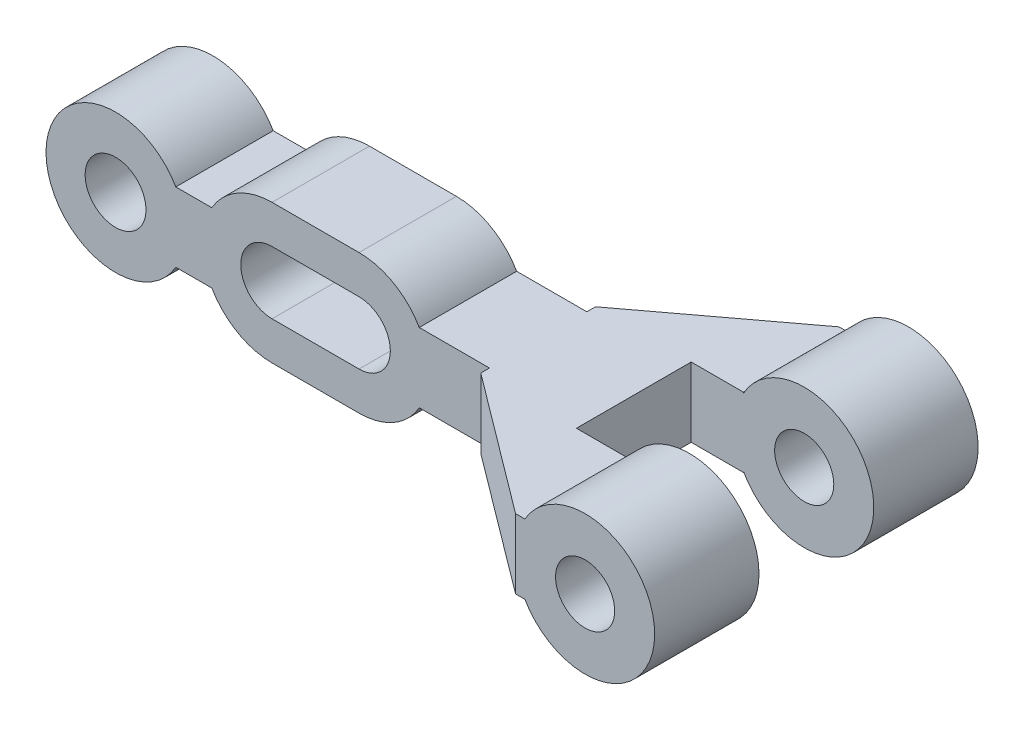
ISO-10303-21;
HEADER;
FILE_DESCRIPTION(('STEP AP214'),'2;1');
FILE_NAME('part.step','',(''),(''),'','','');
FILE_SCHEMA(('AUTOMOTIVE_DESIGN { 1 0 10303 214 1 1 1 1 }'));
ENDSEC;
DATA;
#1=APPLICATION_CONTEXT('core data for automotive mechanical design processes');
#2=APPLICATION_PROTOCOL_DEFINITION('international standard','automotive_design',2000,#1);
#3=PRODUCT_CONTEXT('',#1,'mechanical');
#4=PRODUCT('Part','Part','',(#3));
#5=PRODUCT_RELATED_PRODUCT_CATEGORY('part','',(#4));
#6=PRODUCT_DEFINITION_FORMATION('','',#4);
#7=PRODUCT_DEFINITION_CONTEXT('part definition',#1,'design');
#8=PRODUCT_DEFINITION('design','',#6,#7);
#9=PRODUCT_DEFINITION_SHAPE('','',#8);
#10=(LENGTH_UNIT() NAMED_UNIT(*) SI_UNIT(.MILLI.,.METRE.));
#11=(NAMED_UNIT(*) PLANE_ANGLE_UNIT() SI_UNIT($,.RADIAN.));
#12=(NAMED_UNIT(*) SI_UNIT($,.STERADIAN.) SOLID_ANGLE_UNIT());
#13=UNCERTAINTY_MEASURE_WITH_UNIT(LENGTH_MEASURE(1.E-05),#10,'distance_accuracy_value','');
#14=(GEOMETRIC_REPRESENTATION_CONTEXT(3) GLOBAL_UNCERTAINTY_ASSIGNED_CONTEXT((#13)) GLOBAL_UNIT_ASSIGNED_CONTEXT((#10,
#11,#12)) REPRESENTATION_CONTEXT('',''));
#15=CARTESIAN_POINT('',(0.,0.,0.));
#16=DIRECTION('',(0.,0.,1.));
#17=DIRECTION('',(1.,0.,0.));
#18=AXIS2_PLACEMENT_3D('',#15,#16,#17);
#19=CARTESIAN_POINT('',(-12.,-2.,6.));
#20=DIRECTION('',(-1.,0.,0.));
#21=DIRECTION('',(0.,0.,1.));
#22=AXIS2_PLACEMENT_3D('',#19,#20,#21);
#23=PLANE('',#22);
#24=DIRECTION('',(0.,0.,1.));
#25=VECTOR('',#24,1.);
#26=CARTESIAN_POINT('',(-12.,2.,6.));
#27=LINE('',#26,#25);
#28=CARTESIAN_POINT('',(-12.,2.,12.1));
#29=VERTEX_POINT('',#28);
#30=CARTESIAN_POINT('',(-12.,2.,12.6));
#31=VERTEX_POINT('',#30);
#32=EDGE_CURVE('E382',#29,#31,#27,.T.);
#33=ORIENTED_EDGE('',*,*,#32,.F.);
#34=DIRECTION('',(0.,-1.,0.));
#35=VECTOR('',#34,1.);
#36=CARTESIAN_POINT('',(-12.,2.,12.1));
#37=LINE('',#36,#35);
#38=CARTESIAN_POINT('',(-12.,-2.,12.1));
#39=VERTEX_POINT('',#38);
#40=EDGE_CURVE('E307',#29,#39,#37,.T.);
#41=ORIENTED_EDGE('',*,*,#40,.T.);
#42=DIRECTION('',(0.,0.,1.));
#43=VECTOR('',#42,1.);
#44=CARTESIAN_POINT('',(-12.,-2.,6.));
#45=LINE('',#44,#43);
#46=CARTESIAN_POINT('',(-12.,-2.,12.6));
#47=VERTEX_POINT('',#46);
#48=EDGE_CURVE('E408',#39,#47,#45,.T.);
#49=ORIENTED_EDGE('',*,*,#48,.T.);
#50=DIRECTION('',(0.,1.,0.));
#51=VECTOR('',#50,1.);
#52=CARTESIAN_POINT('',(-12.,-2.,12.6));
#53=LINE('',#52,#51);
#54=EDGE_CURVE('E442',#47,#31,#53,.T.);
#55=ORIENTED_EDGE('',*,*,#54,.T.);
#56=EDGE_LOOP('',(#33,#41,#49,#55));
#57=FACE_BOUND('',#56,.T.);
#58=ADVANCED_FACE('F40',(#57),#23,.T.);
#59=CARTESIAN_POINT('',(0.,0.,6.));
#60=DIRECTION('',(0.,0.,1.));
#61=DIRECTION('',(1.,0.,0.));
#62=AXIS2_PLACEMENT_3D('',#59,#60,#61);
#63=PLANE('',#62);
#64=CARTESIAN_POINT('',(0.,0.,6.));
#65=DIRECTION('',(0.,0.,1.));
#66=DIRECTION('',(1.,0.,0.));
#67=AXIS2_PLACEMENT_3D('',#64,#65,#66);
#68=CIRCLE('',#67,4.);
#69=CARTESIAN_POINT('',(-3.5,-1.93649167310371,6.));
#70=VERTEX_POINT('',#69);
#71=CARTESIAN_POINT('',(-3.5,1.93649167310371,6.));
#72=VERTEX_POINT('',#71);
#73=EDGE_CURVE('E454',#70,#72,#68,.T.);
#74=ORIENTED_EDGE('',*,*,#73,.T.);
#75=DIRECTION('',(0.,1.,0.));
#76=VECTOR('',#75,1.);
#77=CARTESIAN_POINT('',(-3.5,-2.,6.));
#78=LINE('',#77,#76);
#79=CARTESIAN_POINT('',(-3.5,2.,6.));
#80=VERTEX_POINT('',#79);
#81=EDGE_CURVE('E434',#72,#80,#78,.T.);
#82=ORIENTED_EDGE('',*,*,#81,.T.);
#83=DIRECTION('',(1.,0.,0.));
#84=VECTOR('',#83,1.);
#85=CARTESIAN_POINT('',(-6.5,2.,6.));
#86=LINE('',#85,#84);
#87=CARTESIAN_POINT('',(-6.5,2.,6.));
#88=VERTEX_POINT('',#87);
#89=EDGE_CURVE('E396',#88,#80,#86,.T.);
#90=ORIENTED_EDGE('',*,*,#89,.F.);
#91=DIRECTION('',(0.,1.,0.));
#92=VECTOR('',#91,1.);
#93=CARTESIAN_POINT('',(-6.5,-2.,6.));
#94=LINE('',#93,#92);
#95=CARTESIAN_POINT('',(-6.5,-2.,6.));
#96=VERTEX_POINT('',#95);
#97=EDGE_CURVE('E435',#96,#88,#94,.T.);
#98=ORIENTED_EDGE('',*,*,#97,.F.);
#99=DIRECTION('',(1.,0.,0.));
#100=VECTOR('',#99,1.);
#101=CARTESIAN_POINT('',(-6.5,-2.,6.));
#102=LINE('',#101,#100);
#103=CARTESIAN_POINT('',(-3.5,-2.,6.));
#104=VERTEX_POINT('',#103);
#105=EDGE_CURVE('E422',#96,#104,#102,.T.);
#106=ORIENTED_EDGE('',*,*,#105,.T.);
#107=EDGE_CURVE('E432',#104,#70,#78,.T.);
#108=ORIENTED_EDGE('',*,*,#107,.T.);
#109=EDGE_LOOP('',(#74,#82,#90,#98,#106,#108));
#110=FACE_BOUND('',#109,.T.);
#111=CARTESIAN_POINT('',(0.,0.,6.));
#112=DIRECTION('',(0.,0.,1.));
#113=DIRECTION('',(1.,0.,0.));
#114=AXIS2_PLACEMENT_3D('',#111,#112,#113);
#115=CIRCLE('',#114,1.7);
#116=CARTESIAN_POINT('',(1.7,0.,6.));
#117=VERTEX_POINT('',#116);
#118=EDGE_CURVE('E448',#117,#117,#115,.T.);
#119=ORIENTED_EDGE('',*,*,#118,.F.);
#120=EDGE_LOOP('',(#119));
#121=FACE_BOUND('',#120,.T.);
#122=ADVANCED_FACE('F482',(#110,#121),#63,.T.);
#123=CARTESIAN_POINT('',(0.,0.,0.));
#124=DIRECTION('',(0.,0.,1.));
#125=DIRECTION('',(1.,0.,0.));
#126=AXIS2_PLACEMENT_3D('',#123,#124,#125);
#127=PLANE('',#126);
#128=CARTESIAN_POINT('',(0.,0.,0.));
#129=DIRECTION('',(0.,0.,1.));
#130=DIRECTION('',(1.,0.,0.));
#131=AXIS2_PLACEMENT_3D('',#128,#129,#130);
#132=CIRCLE('',#131,4.);
#133=CARTESIAN_POINT('',(-3.5,-1.93649167310371,0.));
#134=VERTEX_POINT('',#133);
#135=CARTESIAN_POINT('',(-3.5,1.93649167310371,0.));
#136=VERTEX_POINT('',#135);
#137=EDGE_CURVE('E451',#134,#136,#132,.T.);
#138=ORIENTED_EDGE('',*,*,#137,.F.);
#139=DIRECTION('',(0.,1.,0.));
#140=VECTOR('',#139,1.);
#141=CARTESIAN_POINT('',(-3.5,-2.,0.));
#142=LINE('',#141,#140);
#143=CARTESIAN_POINT('',(-3.5,-2.,0.));
#144=VERTEX_POINT('',#143);
#145=EDGE_CURVE('E428',#144,#134,#142,.T.);
#146=ORIENTED_EDGE('',*,*,#145,.F.);
#147=DIRECTION('',(-1.,0.,0.));
#148=VECTOR('',#147,1.);
#149=CARTESIAN_POINT('',(-4.,-2.,0.));
#150=LINE('',#149,#148);
#151=CARTESIAN_POINT('',(-4.,-2.,0.));
#152=VERTEX_POINT('',#151);
#153=EDGE_CURVE('E402',#144,#152,#150,.T.);
#154=ORIENTED_EDGE('',*,*,#153,.T.);
#155=DIRECTION('',(0.,1.,0.));
#156=VECTOR('',#155,1.);
#157=CARTESIAN_POINT('',(-4.,-2.,0.));
#158=LINE('',#157,#156);
#159=CARTESIAN_POINT('',(-4.,2.,0.));
#160=VERTEX_POINT('',#159);
#161=EDGE_CURVE('E427',#152,#160,#158,.T.);
#162=ORIENTED_EDGE('',*,*,#161,.T.);
#163=DIRECTION('',(-1.,0.,0.));
#164=VECTOR('',#163,1.);
#165=CARTESIAN_POINT('',(-4.,2.,0.));
#166=LINE('',#165,#164);
#167=CARTESIAN_POINT('',(-3.5,2.,0.));
#168=VERTEX_POINT('',#167);
#169=EDGE_CURVE('E376',#168,#160,#166,.T.);
#170=ORIENTED_EDGE('',*,*,#169,.F.);
#171=EDGE_CURVE('E431',#136,#168,#142,.T.);
#172=ORIENTED_EDGE('',*,*,#171,.F.);
#173=EDGE_LOOP('',(#138,#146,#154,#162,#170,#172));
#174=FACE_BOUND('',#173,.T.);
#175=CARTESIAN_POINT('',(0.,0.,0.));
#176=DIRECTION('',(0.,0.,1.));
#177=DIRECTION('',(1.,0.,0.));
#178=AXIS2_PLACEMENT_3D('',#175,#176,#177);
#179=CIRCLE('',#178,1.7);
#180=CARTESIAN_POINT('',(1.7,0.,0.));
#181=VERTEX_POINT('',#180);
#182=EDGE_CURVE('E430',#181,#181,#179,.T.);
#183=ORIENTED_EDGE('',*,*,#182,.T.);
#184=EDGE_LOOP('',(#183));
#185=FACE_BOUND('',#184,.T.);
#186=ADVANCED_FACE('F470',(#174,#185),#127,.F.);
#187=CARTESIAN_POINT('',(0.,0.,6.));
#188=DIRECTION('',(0.,0.,-1.));
#189=DIRECTION('',(-1.,0.,0.));
#190=AXIS2_PLACEMENT_3D('',#187,#188,#189);
#191=CYLINDRICAL_SURFACE('',#190,4.);
#192=ORIENTED_EDGE('',*,*,#73,.F.);
#193=DIRECTION('',(0.,0.,-1.));
#194=VECTOR('',#193,1.);
#195=CARTESIAN_POINT('',(-3.5,-1.93649167310371,6.));
#196=LINE('',#195,#194);
#197=EDGE_CURVE('E48',#70,#134,#196,.T.);
#198=ORIENTED_EDGE('',*,*,#197,.T.);
#199=ORIENTED_EDGE('',*,*,#137,.T.);
#200=DIRECTION('',(0.,0.,-1.));
#201=VECTOR('',#200,1.);
#202=CARTESIAN_POINT('',(-3.5,1.93649167310371,6.));
#203=LINE('',#202,#201);
#204=EDGE_CURVE('E457',#136,#72,#203,.F.);
#205=ORIENTED_EDGE('',*,*,#204,.T.);
#206=EDGE_LOOP('',(#192,#198,#199,#205));
#207=FACE_BOUND('',#206,.T.);
#208=ADVANCED_FACE('F42',(#207),#191,.T.);
#209=CARTESIAN_POINT('',(0.,0.,6.));
#210=DIRECTION('',(0.,0.,-1.));
#211=DIRECTION('',(-1.,0.,0.));
#212=AXIS2_PLACEMENT_3D('',#209,#210,#211);
#213=CYLINDRICAL_SURFACE('',#212,1.7);
#214=ORIENTED_EDGE('',*,*,#118,.T.);
#215=EDGE_LOOP('',(#214));
#216=FACE_BOUND('',#215,.T.);
#217=ORIENTED_EDGE('',*,*,#182,.F.);
#218=EDGE_LOOP('',(#217));
#219=FACE_BOUND('',#218,.T.);
#220=ADVANCED_FACE('F758',(#216,#219),#213,.F.);
#221=CARTESIAN_POINT('',(-3.5,-2.,0.));
#222=DIRECTION('',(1.,0.,0.));
#223=DIRECTION('',(0.,0.,-1.));
#224=AXIS2_PLACEMENT_3D('',#221,#222,#223);
#225=PLANE('',#224);
#226=ORIENTED_EDGE('',*,*,#197,.F.);
#227=ORIENTED_EDGE('',*,*,#107,.F.);
#228=DIRECTION('',(0.,0.,-1.));
#229=VECTOR('',#228,1.);
#230=CARTESIAN_POINT('',(-3.5,-2.,0.));
#231=LINE('',#230,#229);
#232=EDGE_CURVE('E424',#104,#144,#231,.T.);
#233=ORIENTED_EDGE('',*,*,#232,.T.);
#234=ORIENTED_EDGE('',*,*,#145,.T.);
#235=EDGE_LOOP('',(#226,#227,#233,#234));
#236=FACE_BOUND('',#235,.T.);
#237=ADVANCED_FACE('F486',(#236),#225,.T.);
#238=ORIENTED_EDGE('',*,*,#204,.F.);
#239=ORIENTED_EDGE('',*,*,#171,.T.);
#240=DIRECTION('',(0.,0.,-1.));
#241=VECTOR('',#240,1.);
#242=CARTESIAN_POINT('',(-3.5,2.,0.));
#243=LINE('',#242,#241);
#244=EDGE_CURVE('E399',#80,#168,#243,.T.);
#245=ORIENTED_EDGE('',*,*,#244,.F.);
#246=ORIENTED_EDGE('',*,*,#81,.F.);
#247=EDGE_LOOP('',(#238,#239,#245,#246));
#248=FACE_BOUND('',#247,.T.);
#249=ADVANCED_FACE('F476',(#248),#225,.T.);
#250=CARTESIAN_POINT('',(-6.5,-2.,12.6));
#251=DIRECTION('',(1.,0.,0.));
#252=DIRECTION('',(0.,0.,-1.));
#253=AXIS2_PLACEMENT_3D('',#250,#251,#252);
#254=PLANE('',#253);
#255=ORIENTED_EDGE('',*,*,#97,.T.);
#256=DIRECTION('',(0.,0.,-1.));
#257=VECTOR('',#256,1.);
#258=CARTESIAN_POINT('',(-6.5,2.,12.6));
#259=LINE('',#258,#257);
#260=CARTESIAN_POINT('',(-6.5,2.,12.6));
#261=VERTEX_POINT('',#260);
#262=EDGE_CURVE('E393',#261,#88,#259,.T.);
#263=ORIENTED_EDGE('',*,*,#262,.F.);
#264=DIRECTION('',(0.,1.,0.));
#265=VECTOR('',#264,1.);
#266=CARTESIAN_POINT('',(-6.5,-2.,12.6));
#267=LINE('',#266,#265);
#268=CARTESIAN_POINT('',(-6.5,-2.,12.6));
#269=VERTEX_POINT('',#268);
#270=EDGE_CURVE('E437',#269,#261,#267,.T.);
#271=ORIENTED_EDGE('',*,*,#270,.F.);
#272=DIRECTION('',(0.,0.,-1.));
#273=VECTOR('',#272,1.);
#274=CARTESIAN_POINT('',(-6.5,-2.,12.6));
#275=LINE('',#274,#273);
#276=EDGE_CURVE('E419',#269,#96,#275,.T.);
#277=ORIENTED_EDGE('',*,*,#276,.T.);
#278=EDGE_LOOP('',(#255,#263,#271,#277));
#279=FACE_BOUND('',#278,.T.);
#280=ADVANCED_FACE('F531',(#279),#254,.T.);
#281=CARTESIAN_POINT('',(-4.,-2.,12.6));
#282=DIRECTION('',(0.,0.,-1.));
#283=DIRECTION('',(-1.,0.,0.));
#284=AXIS2_PLACEMENT_3D('',#281,#282,#283);
#285=PLANE('',#284);
#286=DIRECTION('',(-1.,0.,0.));
#287=VECTOR('',#286,1.);
#288=CARTESIAN_POINT('',(-4.,2.,12.6));
#289=LINE('',#288,#287);
#290=CARTESIAN_POINT('',(-3.46410161513775,2.,12.6));
#291=VERTEX_POINT('',#290);
#292=EDGE_CURVE('E391',#291,#261,#289,.T.);
#293=ORIENTED_EDGE('',*,*,#292,.F.);
#294=CARTESIAN_POINT('',(0.,0.,12.6));
#295=DIRECTION('',(0.,0.,1.));
#296=DIRECTION('',(1.,0.,0.));
#297=AXIS2_PLACEMENT_3D('',#294,#295,#296);
#298=CIRCLE('',#297,4.);
#299=CARTESIAN_POINT('',(-3.46410161513775,-2.,12.6));
#300=VERTEX_POINT('',#299);
#301=EDGE_CURVE('E370',#300,#291,#298,.T.);
#302=ORIENTED_EDGE('',*,*,#301,.F.);
#303=DIRECTION('',(-1.,0.,0.));
#304=VECTOR('',#303,1.);
#305=CARTESIAN_POINT('',(-4.,-2.,12.6));
#306=LINE('',#305,#304);
#307=EDGE_CURVE('E417',#300,#269,#306,.T.);
#308=ORIENTED_EDGE('',*,*,#307,.T.);
#309=ORIENTED_EDGE('',*,*,#270,.T.);
#310=EDGE_LOOP('',(#293,#302,#308,#309));
#311=FACE_BOUND('',#310,.T.);
#312=CARTESIAN_POINT('',(0.,0.,12.6));
#313=DIRECTION('',(0.,0.,1.));
#314=DIRECTION('',(1.,0.,0.));
#315=AXIS2_PLACEMENT_3D('',#312,#313,#314);
#316=CIRCLE('',#315,1.7);
#317=CARTESIAN_POINT('',(1.7,0.,12.6));
#318=VERTEX_POINT('',#317);
#319=EDGE_CURVE('E364',#318,#318,#316,.T.);
#320=ORIENTED_EDGE('',*,*,#319,.T.);
#321=EDGE_LOOP('',(#320));
#322=FACE_BOUND('',#321,.T.);
#323=ADVANCED_FACE('F527',(#311,#322),#285,.T.);
#324=CARTESIAN_POINT('',(-3.,-2.,18.6));
#325=DIRECTION('',(0.,0.,1.));
#326=DIRECTION('',(1.,0.,0.));
#327=AXIS2_PLACEMENT_3D('',#324,#325,#326);
#328=PLANE('',#327);
#329=DIRECTION('',(1.,0.,0.));
#330=VECTOR('',#329,1.);
#331=CARTESIAN_POINT('',(-3.,-2.,18.6));
#332=LINE('',#331,#330);
#333=CARTESIAN_POINT('',(-4.,-2.,18.6));
#334=VERTEX_POINT('',#333);
#335=CARTESIAN_POINT('',(-3.46410161513775,-2.,18.6));
#336=VERTEX_POINT('',#335);
#337=EDGE_CURVE('E415',#334,#336,#332,.T.);
#338=ORIENTED_EDGE('',*,*,#337,.T.);
#339=CARTESIAN_POINT('',(0.,0.,18.6));
#340=DIRECTION('',(0.,0.,1.));
#341=DIRECTION('',(1.,0.,0.));
#342=AXIS2_PLACEMENT_3D('',#339,#340,#341);
#343=CIRCLE('',#342,4.);
#344=CARTESIAN_POINT('',(-3.46410161513775,2.,18.6));
#345=VERTEX_POINT('',#344);
#346=EDGE_CURVE('E367',#336,#345,#343,.T.);
#347=ORIENTED_EDGE('',*,*,#346,.T.);
#348=DIRECTION('',(1.,0.,0.));
#349=VECTOR('',#348,1.);
#350=CARTESIAN_POINT('',(-3.,2.,18.6));
#351=LINE('',#350,#349);
#352=CARTESIAN_POINT('',(-4.,2.,18.6));
#353=VERTEX_POINT('',#352);
#354=EDGE_CURVE('E389',#353,#345,#351,.T.);
#355=ORIENTED_EDGE('',*,*,#354,.F.);
#356=DIRECTION('',(0.,1.,0.));
#357=VECTOR('',#356,1.);
#358=CARTESIAN_POINT('',(-4.,-2.,18.6));
#359=LINE('',#358,#357);
#360=EDGE_CURVE('E440',#334,#353,#359,.T.);
#361=ORIENTED_EDGE('',*,*,#360,.F.);
#362=EDGE_LOOP('',(#338,#347,#355,#361));
#363=FACE_BOUND('',#362,.T.);
#364=CARTESIAN_POINT('',(0.,0.,18.6));
#365=DIRECTION('',(0.,0.,1.));
#366=DIRECTION('',(1.,0.,0.));
#367=AXIS2_PLACEMENT_3D('',#364,#365,#366);
#368=CIRCLE('',#367,1.7);
#369=CARTESIAN_POINT('',(1.7,0.,18.6));
#370=VERTEX_POINT('',#369);
#371=EDGE_CURVE('E346',#370,#370,#368,.T.);
#372=ORIENTED_EDGE('',*,*,#371,.F.);
#373=EDGE_LOOP('',(#372));
#374=FACE_BOUND('',#373,.T.);
#375=ADVANCED_FACE('F519',(#363,#374),#328,.T.);
#376=CARTESIAN_POINT('',(-12.,-2.,12.6));
#377=DIRECTION('',(-0.6,0.,0.8));
#378=DIRECTION('',(0.8,0.,0.6));
#379=AXIS2_PLACEMENT_3D('',#376,#377,#378);
#380=PLANE('',#379);
#381=ORIENTED_EDGE('',*,*,#360,.T.);
#382=DIRECTION('',(0.8,0.,0.6));
#383=VECTOR('',#382,1.);
#384=CARTESIAN_POINT('',(-12.,2.,12.6));
#385=LINE('',#384,#383);
#386=EDGE_CURVE('E386',#31,#353,#385,.T.);
#387=ORIENTED_EDGE('',*,*,#386,.F.);
#388=ORIENTED_EDGE('',*,*,#54,.F.);
#389=DIRECTION('',(0.8,0.,0.6));
#390=VECTOR('',#389,1.);
#391=CARTESIAN_POINT('',(-12.,-2.,12.6));
#392=LINE('',#391,#390);
#393=EDGE_CURVE('E412',#47,#334,#392,.T.);
#394=ORIENTED_EDGE('',*,*,#393,.T.);
#395=EDGE_LOOP('',(#381,#387,#388,#394));
#396=FACE_BOUND('',#395,.T.);
#397=ADVANCED_FACE('F514',(#396),#380,.T.);
#398=DIRECTION('',(0.,-1.,0.));
#399=VECTOR('',#398,1.);
#400=CARTESIAN_POINT('',(-12.,2.,6.5));
#401=LINE('',#400,#399);
#402=CARTESIAN_POINT('',(-12.,2.,6.5));
#403=VERTEX_POINT('',#402);
#404=CARTESIAN_POINT('',(-12.,-2.,6.5));
#405=VERTEX_POINT('',#404);
#406=EDGE_CURVE('E260',#403,#405,#401,.T.);
#407=ORIENTED_EDGE('',*,*,#406,.F.);
#408=CARTESIAN_POINT('',(-12.,2.,6.));
#409=VERTEX_POINT('',#408);
#410=EDGE_CURVE('E383',#409,#403,#27,.T.);
#411=ORIENTED_EDGE('',*,*,#410,.F.);
#412=DIRECTION('',(0.,1.,0.));
#413=VECTOR('',#412,1.);
#414=CARTESIAN_POINT('',(-12.,-2.,6.));
#415=LINE('',#414,#413);
#416=CARTESIAN_POINT('',(-12.,-2.,6.));
#417=VERTEX_POINT('',#416);
#418=EDGE_CURVE('E445',#417,#409,#415,.T.);
#419=ORIENTED_EDGE('',*,*,#418,.F.);
#420=EDGE_CURVE('E409',#417,#405,#45,.T.);
#421=ORIENTED_EDGE('',*,*,#420,.T.);
#422=EDGE_LOOP('',(#407,#411,#419,#421));
#423=FACE_BOUND('',#422,.T.);
#424=ADVANCED_FACE('F498',(#423),#23,.T.);
#425=CARTESIAN_POINT('',(-4.,-2.,0.));
#426=DIRECTION('',(-0.6,0.,-0.8));
#427=DIRECTION('',(-0.8,0.,0.6));
#428=AXIS2_PLACEMENT_3D('',#425,#426,#427);
#429=PLANE('',#428);
#430=ORIENTED_EDGE('',*,*,#418,.T.);
#431=DIRECTION('',(-0.8,0.,0.6));
#432=VECTOR('',#431,1.);
#433=CARTESIAN_POINT('',(-4.,2.,0.));
#434=LINE('',#433,#432);
#435=EDGE_CURVE('E379',#160,#409,#434,.T.);
#436=ORIENTED_EDGE('',*,*,#435,.F.);
#437=ORIENTED_EDGE('',*,*,#161,.F.);
#438=DIRECTION('',(-0.8,0.,0.6));
#439=VECTOR('',#438,1.);
#440=CARTESIAN_POINT('',(-4.,-2.,0.));
#441=LINE('',#440,#439);
#442=EDGE_CURVE('E405',#152,#417,#441,.T.);
#443=ORIENTED_EDGE('',*,*,#442,.T.);
#444=EDGE_LOOP('',(#430,#436,#437,#443));
#445=FACE_BOUND('',#444,.T.);
#446=ADVANCED_FACE('F493',(#445),#429,.T.);
#447=CARTESIAN_POINT('',(0.,-2.,0.));
#448=DIRECTION('',(0.,-1.,0.));
#449=DIRECTION('',(0.,0.,-1.));
#450=AXIS2_PLACEMENT_3D('',#447,#448,#449);
#451=PLANE('',#450);
#452=DIRECTION('',(0.,0.,1.));
#453=VECTOR('',#452,1.);
#454=CARTESIAN_POINT('',(-3.46410161513775,-2.,12.6));
#455=LINE('',#454,#453);
#456=EDGE_CURVE('E63',#336,#300,#455,.F.);
#457=ORIENTED_EDGE('',*,*,#456,.F.);
#458=ORIENTED_EDGE('',*,*,#337,.F.);
#459=ORIENTED_EDGE('',*,*,#393,.F.);
#460=ORIENTED_EDGE('',*,*,#48,.F.);
#461=DIRECTION('',(-1.,0.,0.));
#462=VECTOR('',#461,1.);
#463=CARTESIAN_POINT('',(-12.,-2.,12.1));
#464=LINE('',#463,#462);
#465=CARTESIAN_POINT('',(-16.0358983848622,-2.,12.1));
#466=VERTEX_POINT('',#465);
#467=EDGE_CURVE('E55',#39,#466,#464,.T.);
#468=ORIENTED_EDGE('',*,*,#467,.T.);
#469=DIRECTION('',(0.,0.,-1.));
#470=VECTOR('',#469,1.);
#471=CARTESIAN_POINT('',(-16.0358983848622,-2.,12.1));
#472=LINE('',#471,#470);
#473=CARTESIAN_POINT('',(-16.0358983848622,-2.,6.5));
#474=VERTEX_POINT('',#473);
#475=EDGE_CURVE('E343',#466,#474,#472,.T.);
#476=ORIENTED_EDGE('',*,*,#475,.T.);
#477=DIRECTION('',(-1.,0.,0.));
#478=VECTOR('',#477,1.);
#479=CARTESIAN_POINT('',(-12.,-2.,6.5));
#480=LINE('',#479,#478);
#481=EDGE_CURVE('E263',#405,#474,#480,.T.);
#482=ORIENTED_EDGE('',*,*,#481,.F.);
#483=ORIENTED_EDGE('',*,*,#420,.F.);
#484=ORIENTED_EDGE('',*,*,#442,.F.);
#485=ORIENTED_EDGE('',*,*,#153,.F.);
#486=ORIENTED_EDGE('',*,*,#232,.F.);
#487=ORIENTED_EDGE('',*,*,#105,.F.);
#488=ORIENTED_EDGE('',*,*,#276,.F.);
#489=ORIENTED_EDGE('',*,*,#307,.F.);
#490=EDGE_LOOP('',(#457,#458,#459,#460,#468,#476,#482,#483,#484,#485,#486,#487,#488,#489));
#491=FACE_BOUND('',#490,.T.);
#492=ADVANCED_FACE('F487',(#491),#451,.T.);
#493=CARTESIAN_POINT('',(0.,2.,0.));
#494=DIRECTION('',(0.,-1.,0.));
#495=DIRECTION('',(0.,0.,-1.));
#496=AXIS2_PLACEMENT_3D('',#493,#494,#495);
#497=PLANE('',#496);
#498=ORIENTED_EDGE('',*,*,#354,.T.);
#499=DIRECTION('',(0.,0.,1.));
#500=VECTOR('',#499,1.);
#501=CARTESIAN_POINT('',(-3.46410161513775,2.,12.6));
#502=LINE('',#501,#500);
#503=EDGE_CURVE('E11',#345,#291,#502,.F.);
#504=ORIENTED_EDGE('',*,*,#503,.T.);
#505=ORIENTED_EDGE('',*,*,#292,.T.);
#506=ORIENTED_EDGE('',*,*,#262,.T.);
#507=ORIENTED_EDGE('',*,*,#89,.T.);
#508=ORIENTED_EDGE('',*,*,#244,.T.);
#509=ORIENTED_EDGE('',*,*,#169,.T.);
#510=ORIENTED_EDGE('',*,*,#435,.T.);
#511=ORIENTED_EDGE('',*,*,#410,.T.);
#512=DIRECTION('',(1.,0.,0.));
#513=VECTOR('',#512,1.);
#514=CARTESIAN_POINT('',(-12.,2.,6.5));
#515=LINE('',#514,#513);
#516=CARTESIAN_POINT('',(-16.0358983848622,2.,6.5));
#517=VERTEX_POINT('',#516);
#518=EDGE_CURVE('E293',#517,#403,#515,.T.);
#519=ORIENTED_EDGE('',*,*,#518,.F.);
#520=DIRECTION('',(0.,0.,-1.));
#521=VECTOR('',#520,1.);
#522=CARTESIAN_POINT('',(-16.0358983848622,2.,12.1));
#523=LINE('',#522,#521);
#524=CARTESIAN_POINT('',(-16.0358983848622,2.,12.1));
#525=VERTEX_POINT('',#524);
#526=EDGE_CURVE('E344',#525,#517,#523,.T.);
#527=ORIENTED_EDGE('',*,*,#526,.F.);
#528=DIRECTION('',(1.,0.,0.));
#529=VECTOR('',#528,1.);
#530=CARTESIAN_POINT('',(-12.,2.,12.1));
#531=LINE('',#530,#529);
#532=EDGE_CURVE('E340',#525,#29,#531,.T.);
#533=ORIENTED_EDGE('',*,*,#532,.T.);
#534=ORIENTED_EDGE('',*,*,#32,.T.);
#535=ORIENTED_EDGE('',*,*,#386,.T.);
#536=EDGE_LOOP('',(#498,#504,#505,#506,#507,#508,#509,#510,#511,#519,#527,#533,#534,#535));
#537=FACE_BOUND('',#536,.T.);
#538=ADVANCED_FACE('F478',(#537),#497,.F.);
#539=CARTESIAN_POINT('',(0.,0.,12.6));
#540=DIRECTION('',(0.,0.,1.));
#541=DIRECTION('',(1.,0.,0.));
#542=AXIS2_PLACEMENT_3D('',#539,#540,#541);
#543=CYLINDRICAL_SURFACE('',#542,4.);
#544=ORIENTED_EDGE('',*,*,#346,.F.);
#545=ORIENTED_EDGE('',*,*,#456,.T.);
#546=ORIENTED_EDGE('',*,*,#301,.T.);
#547=ORIENTED_EDGE('',*,*,#503,.F.);
#548=EDGE_LOOP('',(#544,#545,#546,#547));
#549=FACE_BOUND('',#548,.T.);
#550=ADVANCED_FACE('F523',(#549),#543,.T.);
#551=CARTESIAN_POINT('',(0.,0.,12.6));
#552=DIRECTION('',(0.,0.,1.));
#553=DIRECTION('',(1.,0.,0.));
#554=AXIS2_PLACEMENT_3D('',#551,#552,#553);
#555=CYLINDRICAL_SURFACE('',#554,1.7);
#556=ORIENTED_EDGE('',*,*,#319,.F.);
#557=EDGE_LOOP('',(#556));
#558=FACE_BOUND('',#557,.T.);
#559=ORIENTED_EDGE('',*,*,#371,.T.);
#560=EDGE_LOOP('',(#559));
#561=FACE_BOUND('',#560,.T.);
#562=ADVANCED_FACE('F609',(#558,#561),#555,.F.);
#563=CARTESIAN_POINT('',(-19.5,0.,12.1));
#564=DIRECTION('',(0.,0.,-1.));
#565=DIRECTION('',(-1.,0.,0.));
#566=AXIS2_PLACEMENT_3D('',#563,#564,#565);
#567=CYLINDRICAL_SURFACE('',#566,4.);
#568=ORIENTED_EDGE('',*,*,#526,.T.);
#569=CARTESIAN_POINT('',(-19.5,0.,6.5));
#570=DIRECTION('',(0.,0.,-1.));
#571=DIRECTION('',(-1.,0.,0.));
#572=AXIS2_PLACEMENT_3D('',#569,#570,#571);
#573=CIRCLE('',#572,4.);
#574=CARTESIAN_POINT('',(-19.5,4.,6.5));
#575=VERTEX_POINT('',#574);
#576=EDGE_CURVE('E290',#575,#517,#573,.T.);
#577=ORIENTED_EDGE('',*,*,#576,.F.);
#578=DIRECTION('',(0.,0.,-1.));
#579=VECTOR('',#578,1.);
#580=CARTESIAN_POINT('',(-19.5,4.,12.1));
#581=LINE('',#580,#579);
#582=CARTESIAN_POINT('',(-19.5,4.,12.1));
#583=VERTEX_POINT('',#582);
#584=EDGE_CURVE('E347',#583,#575,#581,.T.);
#585=ORIENTED_EDGE('',*,*,#584,.F.);
#586=CARTESIAN_POINT('',(-19.5,0.,12.1));
#587=DIRECTION('',(0.,0.,-1.));
#588=DIRECTION('',(-1.,0.,0.));
#589=AXIS2_PLACEMENT_3D('',#586,#587,#588);
#590=CIRCLE('',#589,4.);
#591=EDGE_CURVE('E337',#583,#525,#590,.T.);
#592=ORIENTED_EDGE('',*,*,#591,.T.);
#593=EDGE_LOOP('',(#568,#577,#585,#592));
#594=FACE_BOUND('',#593,.T.);
#595=ADVANCED_FACE('F506',(#594),#567,.T.);
#596=CARTESIAN_POINT('',(-19.5,4.,12.1));
#597=DIRECTION('',(0.,1.,0.));
#598=DIRECTION('',(0.,0.,1.));
#599=AXIS2_PLACEMENT_3D('',#596,#597,#598);
#600=PLANE('',#599);
#601=ORIENTED_EDGE('',*,*,#584,.T.);
#602=DIRECTION('',(1.,0.,0.));
#603=VECTOR('',#602,1.);
#604=CARTESIAN_POINT('',(-19.5,4.,6.5));
#605=LINE('',#604,#603);
#606=CARTESIAN_POINT('',(-24.5,4.,6.5));
#607=VERTEX_POINT('',#606);
#608=EDGE_CURVE('E287',#607,#575,#605,.T.);
#609=ORIENTED_EDGE('',*,*,#608,.F.);
#610=DIRECTION('',(0.,0.,-1.));
#611=VECTOR('',#610,1.);
#612=CARTESIAN_POINT('',(-24.5,4.,12.1));
#613=LINE('',#612,#611);
#614=CARTESIAN_POINT('',(-24.5,4.,12.1));
#615=VERTEX_POINT('',#614);
#616=EDGE_CURVE('E349',#615,#607,#613,.T.);
#617=ORIENTED_EDGE('',*,*,#616,.F.);
#618=DIRECTION('',(1.,0.,0.));
#619=VECTOR('',#618,1.);
#620=CARTESIAN_POINT('',(-19.5,4.,12.1));
#621=LINE('',#620,#619);
#622=EDGE_CURVE('E334',#615,#583,#621,.T.);
#623=ORIENTED_EDGE('',*,*,#622,.T.);
#624=EDGE_LOOP('',(#601,#609,#617,#623));
#625=FACE_BOUND('',#624,.T.);
#626=ADVANCED_FACE('F608',(#625),#600,.T.);
#627=CARTESIAN_POINT('',(-24.5,0.,12.1));
#628=DIRECTION('',(0.,0.,-1.));
#629=DIRECTION('',(-1.,0.,0.));
#630=AXIS2_PLACEMENT_3D('',#627,#628,#629);
#631=CYLINDRICAL_SURFACE('',#630,4.);
#632=ORIENTED_EDGE('',*,*,#616,.T.);
#633=CARTESIAN_POINT('',(-24.5,0.,6.5));
#634=DIRECTION('',(0.,0.,-1.));
#635=DIRECTION('',(-1.,0.,0.));
#636=AXIS2_PLACEMENT_3D('',#633,#634,#635);
#637=CIRCLE('',#636,4.);
#638=CARTESIAN_POINT('',(-27.9641016151378,2.,6.5));
#639=VERTEX_POINT('',#638);
#640=EDGE_CURVE('E284',#639,#607,#637,.T.);
#641=ORIENTED_EDGE('',*,*,#640,.F.);
#642=DIRECTION('',(0.,0.,-1.));
#643=VECTOR('',#642,1.);
#644=CARTESIAN_POINT('',(-27.9641016151378,2.,12.1));
#645=LINE('',#644,#643);
#646=CARTESIAN_POINT('',(-27.9641016151378,2.,12.1));
#647=VERTEX_POINT('',#646);
#648=EDGE_CURVE('E351',#647,#639,#645,.T.);
#649=ORIENTED_EDGE('',*,*,#648,.F.);
#650=CARTESIAN_POINT('',(-24.5,0.,12.1));
#651=DIRECTION('',(0.,0.,-1.));
#652=DIRECTION('',(-1.,0.,0.));
#653=AXIS2_PLACEMENT_3D('',#650,#651,#652);
#654=CIRCLE('',#653,4.);
#655=EDGE_CURVE('E331',#647,#615,#654,.T.);
#656=ORIENTED_EDGE('',*,*,#655,.T.);
#657=EDGE_LOOP('',(#632,#641,#649,#656));
#658=FACE_BOUND('',#657,.T.);
#659=ADVANCED_FACE('F618',(#658),#631,.T.);
#660=CARTESIAN_POINT('',(-27.9641016151378,2.,12.1));
#661=DIRECTION('',(0.,1.,0.));
#662=DIRECTION('',(0.,0.,1.));
#663=AXIS2_PLACEMENT_3D('',#660,#661,#662);
#664=PLANE('',#663);
#665=ORIENTED_EDGE('',*,*,#648,.T.);
#666=DIRECTION('',(1.,0.,0.));
#667=VECTOR('',#666,1.);
#668=CARTESIAN_POINT('',(-27.9641016151378,2.,6.5));
#669=LINE('',#668,#667);
#670=CARTESIAN_POINT('',(-30.0358983848622,2.,6.5));
#671=VERTEX_POINT('',#670);
#672=EDGE_CURVE('E281',#671,#639,#669,.T.);
#673=ORIENTED_EDGE('',*,*,#672,.F.);
#674=DIRECTION('',(0.,0.,-1.));
#675=VECTOR('',#674,1.);
#676=CARTESIAN_POINT('',(-30.0358983848622,2.,12.1));
#677=LINE('',#676,#675);
#678=CARTESIAN_POINT('',(-30.0358983848622,2.,12.1));
#679=VERTEX_POINT('',#678);
#680=EDGE_CURVE('E353',#679,#671,#677,.T.);
#681=ORIENTED_EDGE('',*,*,#680,.F.);
#682=DIRECTION('',(1.,0.,0.));
#683=VECTOR('',#682,1.);
#684=CARTESIAN_POINT('',(-27.9641016151378,2.,12.1));
#685=LINE('',#684,#683);
#686=EDGE_CURVE('E328',#679,#647,#685,.T.);
#687=ORIENTED_EDGE('',*,*,#686,.T.);
#688=EDGE_LOOP('',(#665,#673,#681,#687));
#689=FACE_BOUND('',#688,.T.);
#690=ADVANCED_FACE('F628',(#689),#664,.T.);
#691=CARTESIAN_POINT('',(-33.5,0.,12.1));
#692=DIRECTION('',(0.,0.,-1.));
#693=DIRECTION('',(-1.,0.,0.));
#694=AXIS2_PLACEMENT_3D('',#691,#692,#693);
#695=CYLINDRICAL_SURFACE('',#694,4.);
#696=ORIENTED_EDGE('',*,*,#680,.T.);
#697=CARTESIAN_POINT('',(-33.5,0.,6.5));
#698=DIRECTION('',(0.,0.,-1.));
#699=DIRECTION('',(-1.,0.,0.));
#700=AXIS2_PLACEMENT_3D('',#697,#698,#699);
#701=CIRCLE('',#700,4.);
#702=CARTESIAN_POINT('',(-30.0358983848622,-2.,6.5));
#703=VERTEX_POINT('',#702);
#704=EDGE_CURVE('E278',#703,#671,#701,.T.);
#705=ORIENTED_EDGE('',*,*,#704,.F.);
#706=DIRECTION('',(0.,0.,-1.));
#707=VECTOR('',#706,1.);
#708=CARTESIAN_POINT('',(-30.0358983848622,-2.,12.1));
#709=LINE('',#708,#707);
#710=CARTESIAN_POINT('',(-30.0358983848622,-2.,12.1));
#711=VERTEX_POINT('',#710);
#712=EDGE_CURVE('E355',#711,#703,#709,.T.);
#713=ORIENTED_EDGE('',*,*,#712,.F.);
#714=CARTESIAN_POINT('',(-33.5,0.,12.1));
#715=DIRECTION('',(0.,0.,-1.));
#716=DIRECTION('',(-1.,0.,0.));
#717=AXIS2_PLACEMENT_3D('',#714,#715,#716);
#718=CIRCLE('',#717,4.);
#719=EDGE_CURVE('E325',#711,#679,#718,.T.);
#720=ORIENTED_EDGE('',*,*,#719,.T.);
#721=EDGE_LOOP('',(#696,#705,#713,#720));
#722=FACE_BOUND('',#721,.T.);
#723=ADVANCED_FACE('F638',(#722),#695,.T.);
#724=CARTESIAN_POINT('',(-27.9641016151378,-2.,12.1));
#725=DIRECTION('',(0.,-1.,0.));
#726=DIRECTION('',(0.,0.,-1.));
#727=AXIS2_PLACEMENT_3D('',#724,#725,#726);
#728=PLANE('',#727);
#729=ORIENTED_EDGE('',*,*,#712,.T.);
#730=DIRECTION('',(-1.,0.,0.));
#731=VECTOR('',#730,1.);
#732=CARTESIAN_POINT('',(-27.9641016151378,-2.,6.5));
#733=LINE('',#732,#731);
#734=CARTESIAN_POINT('',(-27.9641016151378,-2.,6.5));
#735=VERTEX_POINT('',#734);
#736=EDGE_CURVE('E275',#735,#703,#733,.T.);
#737=ORIENTED_EDGE('',*,*,#736,.F.);
#738=DIRECTION('',(0.,0.,-1.));
#739=VECTOR('',#738,1.);
#740=CARTESIAN_POINT('',(-27.9641016151378,-2.,12.1));
#741=LINE('',#740,#739);
#742=CARTESIAN_POINT('',(-27.9641016151378,-2.,12.1));
#743=VERTEX_POINT('',#742);
#744=EDGE_CURVE('E357',#743,#735,#741,.T.);
#745=ORIENTED_EDGE('',*,*,#744,.F.);
#746=DIRECTION('',(-1.,0.,0.));
#747=VECTOR('',#746,1.);
#748=CARTESIAN_POINT('',(-27.9641016151378,-2.,12.1));
#749=LINE('',#748,#747);
#750=EDGE_CURVE('E322',#743,#711,#749,.T.);
#751=ORIENTED_EDGE('',*,*,#750,.T.);
#752=EDGE_LOOP('',(#729,#737,#745,#751));
#753=FACE_BOUND('',#752,.T.);
#754=ADVANCED_FACE('F648',(#753),#728,.T.);
#755=CARTESIAN_POINT('',(-24.5,0.,12.1));
#756=DIRECTION('',(0.,0.,-1.));
#757=DIRECTION('',(-1.,0.,0.));
#758=AXIS2_PLACEMENT_3D('',#755,#756,#757);
#759=CYLINDRICAL_SURFACE('',#758,4.);
#760=ORIENTED_EDGE('',*,*,#744,.T.);
#761=CARTESIAN_POINT('',(-24.5,0.,6.5));
#762=DIRECTION('',(0.,0.,-1.));
#763=DIRECTION('',(-1.,0.,0.));
#764=AXIS2_PLACEMENT_3D('',#761,#762,#763);
#765=CIRCLE('',#764,4.);
#766=CARTESIAN_POINT('',(-24.5,-4.,6.5));
#767=VERTEX_POINT('',#766);
#768=EDGE_CURVE('E272',#767,#735,#765,.T.);
#769=ORIENTED_EDGE('',*,*,#768,.F.);
#770=DIRECTION('',(0.,0.,-1.));
#771=VECTOR('',#770,1.);
#772=CARTESIAN_POINT('',(-24.5,-4.,12.1));
#773=LINE('',#772,#771);
#774=CARTESIAN_POINT('',(-24.5,-4.,12.1));
#775=VERTEX_POINT('',#774);
#776=EDGE_CURVE('E359',#775,#767,#773,.T.);
#777=ORIENTED_EDGE('',*,*,#776,.F.);
#778=CARTESIAN_POINT('',(-24.5,0.,12.1));
#779=DIRECTION('',(0.,0.,-1.));
#780=DIRECTION('',(-1.,0.,0.));
#781=AXIS2_PLACEMENT_3D('',#778,#779,#780);
#782=CIRCLE('',#781,4.);
#783=EDGE_CURVE('E319',#775,#743,#782,.T.);
#784=ORIENTED_EDGE('',*,*,#783,.T.);
#785=EDGE_LOOP('',(#760,#769,#777,#784));
#786=FACE_BOUND('',#785,.T.);
#787=ADVANCED_FACE('F658',(#786),#759,.T.);
#788=CARTESIAN_POINT('',(-19.5,-4.,12.1));
#789=DIRECTION('',(0.,-1.,0.));
#790=DIRECTION('',(0.,0.,-1.));
#791=AXIS2_PLACEMENT_3D('',#788,#789,#790);
#792=PLANE('',#791);
#793=ORIENTED_EDGE('',*,*,#776,.T.);
#794=DIRECTION('',(-1.,0.,0.));
#795=VECTOR('',#794,1.);
#796=CARTESIAN_POINT('',(-19.5,-4.,6.5));
#797=LINE('',#796,#795);
#798=CARTESIAN_POINT('',(-19.5,-4.,6.5));
#799=VERTEX_POINT('',#798);
#800=EDGE_CURVE('E269',#799,#767,#797,.T.);
#801=ORIENTED_EDGE('',*,*,#800,.F.);
#802=DIRECTION('',(0.,0.,-1.));
#803=VECTOR('',#802,1.);
#804=CARTESIAN_POINT('',(-19.5,-4.,12.1));
#805=LINE('',#804,#803);
#806=CARTESIAN_POINT('',(-19.5,-4.,12.1));
#807=VERTEX_POINT('',#806);
#808=EDGE_CURVE('E361',#807,#799,#805,.T.);
#809=ORIENTED_EDGE('',*,*,#808,.F.);
#810=DIRECTION('',(-1.,0.,0.));
#811=VECTOR('',#810,1.);
#812=CARTESIAN_POINT('',(-19.5,-4.,12.1));
#813=LINE('',#812,#811);
#814=EDGE_CURVE('E316',#807,#775,#813,.T.);
#815=ORIENTED_EDGE('',*,*,#814,.T.);
#816=EDGE_LOOP('',(#793,#801,#809,#815));
#817=FACE_BOUND('',#816,.T.);
#818=ADVANCED_FACE('F668',(#817),#792,.T.);
#819=CARTESIAN_POINT('',(-19.5,0.,12.1));
#820=DIRECTION('',(0.,0.,-1.));
#821=DIRECTION('',(-1.,0.,0.));
#822=AXIS2_PLACEMENT_3D('',#819,#820,#821);
#823=CYLINDRICAL_SURFACE('',#822,4.);
#824=ORIENTED_EDGE('',*,*,#808,.T.);
#825=CARTESIAN_POINT('',(-19.5,0.,6.5));
#826=DIRECTION('',(0.,0.,-1.));
#827=DIRECTION('',(-1.,0.,0.));
#828=AXIS2_PLACEMENT_3D('',#825,#826,#827);
#829=CIRCLE('',#828,4.);
#830=EDGE_CURVE('E266',#474,#799,#829,.T.);
#831=ORIENTED_EDGE('',*,*,#830,.F.);
#832=ORIENTED_EDGE('',*,*,#475,.F.);
#833=CARTESIAN_POINT('',(-19.5,0.,12.1));
#834=DIRECTION('',(0.,0.,-1.));
#835=DIRECTION('',(-1.,0.,0.));
#836=AXIS2_PLACEMENT_3D('',#833,#834,#835);
#837=CIRCLE('',#836,4.);
#838=EDGE_CURVE('E313',#466,#807,#837,.T.);
#839=ORIENTED_EDGE('',*,*,#838,.T.);
#840=EDGE_LOOP('',(#824,#831,#832,#839));
#841=FACE_BOUND('',#840,.T.);
#842=ADVANCED_FACE('F678',(#841),#823,.T.);
#843=CARTESIAN_POINT('',(-19.5,0.,12.1));
#844=DIRECTION('',(0.,0.,-1.));
#845=DIRECTION('',(-1.,0.,0.));
#846=AXIS2_PLACEMENT_3D('',#843,#844,#845);
#847=PLANE('',#846);
#848=CARTESIAN_POINT('',(-33.5,0.,12.1));
#849=DIRECTION('',(0.,0.,-1.));
#850=DIRECTION('',(-1.,0.,0.));
#851=AXIS2_PLACEMENT_3D('',#848,#849,#850);
#852=CIRCLE('',#851,1.75);
#853=CARTESIAN_POINT('',(-35.25,0.,12.1));
#854=VERTEX_POINT('',#853);
#855=EDGE_CURVE('E295',#854,#854,#852,.T.);
#856=ORIENTED_EDGE('',*,*,#855,.T.);
#857=EDGE_LOOP('',(#856));
#858=FACE_BOUND('',#857,.T.);
#859=DIRECTION('',(1.,0.,0.));
#860=VECTOR('',#859,1.);
#861=CARTESIAN_POINT('',(-19.5,1.8,12.1));
#862=LINE('',#861,#860);
#863=CARTESIAN_POINT('',(-24.5,1.8,12.1));
#864=VERTEX_POINT('',#863);
#865=CARTESIAN_POINT('',(-19.5,1.8,12.1));
#866=VERTEX_POINT('',#865);
#867=EDGE_CURVE('E239',#864,#866,#862,.T.);
#868=ORIENTED_EDGE('',*,*,#867,.T.);
#869=CARTESIAN_POINT('',(-19.5,0.,12.1));
#870=DIRECTION('',(0.,0.,-1.));
#871=DIRECTION('',(-1.,0.,0.));
#872=AXIS2_PLACEMENT_3D('',#869,#870,#871);
#873=CIRCLE('',#872,1.8);
#874=CARTESIAN_POINT('',(-19.5,-1.8,12.1));
#875=VERTEX_POINT('',#874);
#876=EDGE_CURVE('E298',#866,#875,#873,.T.);
#877=ORIENTED_EDGE('',*,*,#876,.T.);
#878=DIRECTION('',(-1.,0.,0.));
#879=VECTOR('',#878,1.);
#880=CARTESIAN_POINT('',(-19.5,-1.8,12.1));
#881=LINE('',#880,#879);
#882=CARTESIAN_POINT('',(-24.5,-1.8,12.1));
#883=VERTEX_POINT('',#882);
#884=EDGE_CURVE('E234',#875,#883,#881,.T.);
#885=ORIENTED_EDGE('',*,*,#884,.T.);
#886=CARTESIAN_POINT('',(-24.5,0.,12.1));
#887=DIRECTION('',(0.,0.,-1.));
#888=DIRECTION('',(-1.,0.,0.));
#889=AXIS2_PLACEMENT_3D('',#886,#887,#888);
#890=CIRCLE('',#889,1.8);
#891=EDGE_CURVE('E301',#883,#864,#890,.T.);
#892=ORIENTED_EDGE('',*,*,#891,.T.);
#893=EDGE_LOOP('',(#868,#877,#885,#892));
#894=FACE_BOUND('',#893,.T.);
#895=ORIENTED_EDGE('',*,*,#40,.F.);
#896=ORIENTED_EDGE('',*,*,#532,.F.);
#897=ORIENTED_EDGE('',*,*,#591,.F.);
#898=ORIENTED_EDGE('',*,*,#622,.F.);
#899=ORIENTED_EDGE('',*,*,#655,.F.);
#900=ORIENTED_EDGE('',*,*,#686,.F.);
#901=ORIENTED_EDGE('',*,*,#719,.F.);
#902=ORIENTED_EDGE('',*,*,#750,.F.);
#903=ORIENTED_EDGE('',*,*,#783,.F.);
#904=ORIENTED_EDGE('',*,*,#814,.F.);
#905=ORIENTED_EDGE('',*,*,#838,.F.);
#906=ORIENTED_EDGE('',*,*,#467,.F.);
#907=EDGE_LOOP('',(#895,#896,#897,#898,#899,#900,#901,#902,#903,#904,#905,#906));
#908=FACE_BOUND('',#907,.T.);
#909=ADVANCED_FACE('F508',(#858,#894,#908),#847,.F.);
#910=CARTESIAN_POINT('',(-19.5,0.,12.1));
#911=DIRECTION('',(0.,0.,-1.));
#912=DIRECTION('',(-1.,0.,0.));
#913=AXIS2_PLACEMENT_3D('',#910,#911,#912);
#914=CYLINDRICAL_SURFACE('',#913,1.8);
#915=DIRECTION('',(0.,0.,-1.));
#916=VECTOR('',#915,1.);
#917=CARTESIAN_POINT('',(-19.5,1.8,12.1));
#918=LINE('',#917,#916);
#919=CARTESIAN_POINT('',(-19.5,1.8,6.5));
#920=VERTEX_POINT('',#919);
#921=EDGE_CURVE('E244',#866,#920,#918,.T.);
#922=ORIENTED_EDGE('',*,*,#921,.T.);
#923=CARTESIAN_POINT('',(-19.5,0.,6.5));
#924=DIRECTION('',(0.,0.,-1.));
#925=DIRECTION('',(-1.,0.,0.));
#926=AXIS2_PLACEMENT_3D('',#923,#924,#925);
#927=CIRCLE('',#926,1.8);
#928=CARTESIAN_POINT('',(-19.5,-1.8,6.5));
#929=VERTEX_POINT('',#928);
#930=EDGE_CURVE('E242',#920,#929,#927,.T.);
#931=ORIENTED_EDGE('',*,*,#930,.T.);
#932=DIRECTION('',(0.,0.,-1.));
#933=VECTOR('',#932,1.);
#934=CARTESIAN_POINT('',(-19.5,-1.8,12.1));
#935=LINE('',#934,#933);
#936=EDGE_CURVE('E226',#875,#929,#935,.T.);
#937=ORIENTED_EDGE('',*,*,#936,.F.);
#938=ORIENTED_EDGE('',*,*,#876,.F.);
#939=EDGE_LOOP('',(#922,#931,#937,#938));
#940=FACE_BOUND('',#939,.T.);
#941=ADVANCED_FACE('F243',(#940),#914,.F.);
#942=CARTESIAN_POINT('',(-19.5,1.8,12.1));
#943=DIRECTION('',(0.,1.,0.));
#944=DIRECTION('',(-1.,0.,0.));
#945=AXIS2_PLACEMENT_3D('',#942,#943,#944);
#946=PLANE('',#945);
#947=DIRECTION('',(0.,0.,-1.));
#948=VECTOR('',#947,1.);
#949=CARTESIAN_POINT('',(-24.5,1.8,12.1));
#950=LINE('',#949,#948);
#951=CARTESIAN_POINT('',(-24.5,1.8,6.5));
#952=VERTEX_POINT('',#951);
#953=EDGE_CURVE('E308',#864,#952,#950,.T.);
#954=ORIENTED_EDGE('',*,*,#953,.T.);
#955=DIRECTION('',(1.,0.,0.));
#956=VECTOR('',#955,1.);
#957=CARTESIAN_POINT('',(-19.5,1.8,6.5));
#958=LINE('',#957,#956);
#959=EDGE_CURVE('E255',#952,#920,#958,.T.);
#960=ORIENTED_EDGE('',*,*,#959,.T.);
#961=ORIENTED_EDGE('',*,*,#921,.F.);
#962=ORIENTED_EDGE('',*,*,#867,.F.);
#963=EDGE_LOOP('',(#954,#960,#961,#962));
#964=FACE_BOUND('',#963,.T.);
#965=ADVANCED_FACE('F706',(#964),#946,.F.);
#966=CARTESIAN_POINT('',(-24.5,0.,12.1));
#967=DIRECTION('',(0.,0.,-1.));
#968=DIRECTION('',(-1.,0.,0.));
#969=AXIS2_PLACEMENT_3D('',#966,#967,#968);
#970=CYLINDRICAL_SURFACE('',#969,1.8);
#971=DIRECTION('',(0.,0.,-1.));
#972=VECTOR('',#971,1.);
#973=CARTESIAN_POINT('',(-24.5,-1.8,12.1));
#974=LINE('',#973,#972);
#975=CARTESIAN_POINT('',(-24.5,-1.8,6.5));
#976=VERTEX_POINT('',#975);
#977=EDGE_CURVE('E238',#883,#976,#974,.T.);
#978=ORIENTED_EDGE('',*,*,#977,.T.);
#979=CARTESIAN_POINT('',(-24.5,0.,6.5));
#980=DIRECTION('',(0.,0.,-1.));
#981=DIRECTION('',(-1.,0.,0.));
#982=AXIS2_PLACEMENT_3D('',#979,#980,#981);
#983=CIRCLE('',#982,1.8);
#984=EDGE_CURVE('E253',#976,#952,#983,.T.);
#985=ORIENTED_EDGE('',*,*,#984,.T.);
#986=ORIENTED_EDGE('',*,*,#953,.F.);
#987=ORIENTED_EDGE('',*,*,#891,.F.);
#988=EDGE_LOOP('',(#978,#985,#986,#987));
#989=FACE_BOUND('',#988,.T.);
#990=ADVANCED_FACE('F715',(#989),#970,.F.);
#991=CARTESIAN_POINT('',(-19.5,-1.8,12.1));
#992=DIRECTION('',(0.,-1.,0.));
#993=DIRECTION('',(1.,0.,0.));
#994=AXIS2_PLACEMENT_3D('',#991,#992,#993);
#995=PLANE('',#994);
#996=ORIENTED_EDGE('',*,*,#936,.T.);
#997=DIRECTION('',(-1.,0.,0.));
#998=VECTOR('',#997,1.);
#999=CARTESIAN_POINT('',(-19.5,-1.8,6.5));
#1000=LINE('',#999,#998);
#1001=EDGE_CURVE('E231',#929,#976,#1000,.T.);
#1002=ORIENTED_EDGE('',*,*,#1001,.T.);
#1003=ORIENTED_EDGE('',*,*,#977,.F.);
#1004=ORIENTED_EDGE('',*,*,#884,.F.);
#1005=EDGE_LOOP('',(#996,#1002,#1003,#1004));
#1006=FACE_BOUND('',#1005,.T.);
#1007=ADVANCED_FACE('F228',(#1006),#995,.F.);
#1008=CARTESIAN_POINT('',(-33.5,0.,12.1));
#1009=DIRECTION('',(0.,0.,-1.));
#1010=DIRECTION('',(-1.,0.,0.));
#1011=AXIS2_PLACEMENT_3D('',#1008,#1009,#1010);
#1012=CYLINDRICAL_SURFACE('',#1011,1.75);
#1013=ORIENTED_EDGE('',*,*,#855,.F.);
#1014=EDGE_LOOP('',(#1013));
#1015=FACE_BOUND('',#1014,.T.);
#1016=CARTESIAN_POINT('',(-33.5,0.,6.5));
#1017=DIRECTION('',(0.,0.,-1.));
#1018=DIRECTION('',(-1.,0.,0.));
#1019=AXIS2_PLACEMENT_3D('',#1016,#1017,#1018);
#1020=CIRCLE('',#1019,1.75);
#1021=CARTESIAN_POINT('',(-35.25,0.,6.5));
#1022=VERTEX_POINT('',#1021);
#1023=EDGE_CURVE('E248',#1022,#1022,#1020,.T.);
#1024=ORIENTED_EDGE('',*,*,#1023,.T.);
#1025=EDGE_LOOP('',(#1024));
#1026=FACE_BOUND('',#1025,.T.);
#1027=ADVANCED_FACE('F734',(#1015,#1026),#1012,.F.);
#1028=CARTESIAN_POINT('',(-19.5,0.,6.5));
#1029=DIRECTION('',(0.,0.,-1.));
#1030=DIRECTION('',(-1.,0.,0.));
#1031=AXIS2_PLACEMENT_3D('',#1028,#1029,#1030);
#1032=PLANE('',#1031);
#1033=ORIENTED_EDGE('',*,*,#1001,.F.);
#1034=ORIENTED_EDGE('',*,*,#930,.F.);
#1035=ORIENTED_EDGE('',*,*,#959,.F.);
#1036=ORIENTED_EDGE('',*,*,#984,.F.);
#1037=EDGE_LOOP('',(#1033,#1034,#1035,#1036));
#1038=FACE_BOUND('',#1037,.T.);
#1039=ORIENTED_EDGE('',*,*,#406,.T.);
#1040=ORIENTED_EDGE('',*,*,#481,.T.);
#1041=ORIENTED_EDGE('',*,*,#830,.T.);
#1042=ORIENTED_EDGE('',*,*,#800,.T.);
#1043=ORIENTED_EDGE('',*,*,#768,.T.);
#1044=ORIENTED_EDGE('',*,*,#736,.T.);
#1045=ORIENTED_EDGE('',*,*,#704,.T.);
#1046=ORIENTED_EDGE('',*,*,#672,.T.);
#1047=ORIENTED_EDGE('',*,*,#640,.T.);
#1048=ORIENTED_EDGE('',*,*,#608,.T.);
#1049=ORIENTED_EDGE('',*,*,#576,.T.);
#1050=ORIENTED_EDGE('',*,*,#518,.T.);
#1051=EDGE_LOOP('',(#1039,#1040,#1041,#1042,#1043,#1044,#1045,#1046,#1047,#1048,#1049,#1050));
#1052=FACE_BOUND('',#1051,.T.);
#1053=ORIENTED_EDGE('',*,*,#1023,.F.);
#1054=EDGE_LOOP('',(#1053));
#1055=FACE_BOUND('',#1054,.T.);
#1056=ADVANCED_FACE('F250',(#1038,#1052,#1055),#1032,.T.);
#1057=CLOSED_SHELL('',(#58,#122,#186,#208,#220,#237,#249,#280,#323,#375,#397,#424,#446,#492,
#538,#550,#562,#595,#626,#659,#690,#723,#754,#787,#818,#842,#909,#941,#965,#990,#1007,#1027,#1056));
#1058=MANIFOLD_SOLID_BREP('B2',#1057);
#1059=ADVANCED_BREP_SHAPE_REPRESENTATION('',(#18,#1058),#14);
#1060=SHAPE_DEFINITION_REPRESENTATION(#9,#1059);
ENDSEC;
END-ISO-10303-21;
